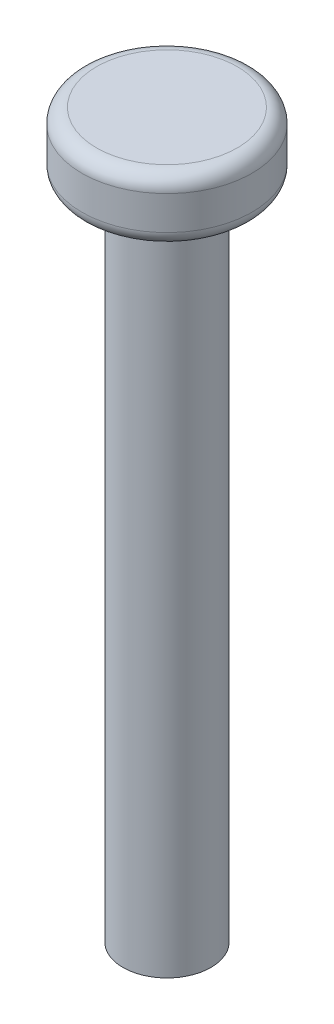
ISO-10303-21;
HEADER;
FILE_DESCRIPTION(('STEP AP214'),'2;1');
FILE_NAME('part.step','',(''),(''),'','','');
FILE_SCHEMA(('AUTOMOTIVE_DESIGN { 1 0 10303 214 1 1 1 1 }'));
ENDSEC;
DATA;
#1=APPLICATION_CONTEXT('core data for automotive mechanical design processes');
#2=APPLICATION_PROTOCOL_DEFINITION('international standard','automotive_design',2000,#1);
#3=PRODUCT_CONTEXT('',#1,'mechanical');
#4=PRODUCT('Part','Part','',(#3));
#5=PRODUCT_RELATED_PRODUCT_CATEGORY('part','',(#4));
#6=PRODUCT_DEFINITION_FORMATION('','',#4);
#7=PRODUCT_DEFINITION_CONTEXT('part definition',#1,'design');
#8=PRODUCT_DEFINITION('design','',#6,#7);
#9=PRODUCT_DEFINITION_SHAPE('','',#8);
#10=(LENGTH_UNIT() NAMED_UNIT(*) SI_UNIT(.MILLI.,.METRE.));
#11=(NAMED_UNIT(*) PLANE_ANGLE_UNIT() SI_UNIT($,.RADIAN.));
#12=(NAMED_UNIT(*) SI_UNIT($,.STERADIAN.) SOLID_ANGLE_UNIT());
#13=UNCERTAINTY_MEASURE_WITH_UNIT(LENGTH_MEASURE(1.E-05),#10,'distance_accuracy_value','');
#14=(GEOMETRIC_REPRESENTATION_CONTEXT(3) GLOBAL_UNCERTAINTY_ASSIGNED_CONTEXT((#13)) GLOBAL_UNIT_ASSIGNED_CONTEXT((#10,
#11,#12)) REPRESENTATION_CONTEXT('',''));
#15=CARTESIAN_POINT('',(0.,0.,0.));
#16=DIRECTION('',(0.,0.,1.));
#17=DIRECTION('',(1.,0.,0.));
#18=AXIS2_PLACEMENT_3D('',#15,#16,#17);
#19=CARTESIAN_POINT('',(0.,45.,0.));
#20=DIRECTION('',(0.,-1.,0.));
#21=DIRECTION('',(0.,0.,-1.));
#22=AXIS2_PLACEMENT_3D('',#19,#20,#21);
#23=CYLINDRICAL_SURFACE('',#22,3.);
#24=CARTESIAN_POINT('',(0.,45.,0.));
#25=DIRECTION('',(0.,1.,0.));
#26=DIRECTION('',(0.,0.,1.));
#27=AXIS2_PLACEMENT_3D('',#24,#25,#26);
#28=CIRCLE('',#27,3.);
#29=CARTESIAN_POINT('',(0.,45.,3.));
#30=VERTEX_POINT('',#29);
#31=EDGE_CURVE('E53',#30,#30,#28,.T.);
#32=ORIENTED_EDGE('',*,*,#31,.F.);
#33=EDGE_LOOP('',(#32));
#34=FACE_BOUND('',#33,.T.);
#35=CARTESIAN_POINT('',(0.,0.,0.));
#36=DIRECTION('',(0.,1.,0.));
#37=DIRECTION('',(0.,0.,1.));
#38=AXIS2_PLACEMENT_3D('',#35,#36,#37);
#39=CIRCLE('',#38,3.);
#40=CARTESIAN_POINT('',(0.,0.,3.));
#41=VERTEX_POINT('',#40);
#42=EDGE_CURVE('E54',#41,#41,#39,.T.);
#43=ORIENTED_EDGE('',*,*,#42,.T.);
#44=EDGE_LOOP('',(#43));
#45=FACE_BOUND('',#44,.T.);
#46=ADVANCED_FACE('F33',(#34,#45),#23,.T.);
#47=CARTESIAN_POINT('',(0.,0.,0.));
#48=DIRECTION('',(0.,1.,0.));
#49=DIRECTION('',(0.,0.,1.));
#50=AXIS2_PLACEMENT_3D('',#47,#48,#49);
#51=PLANE('',#50);
#52=ORIENTED_EDGE('',*,*,#42,.F.);
#53=EDGE_LOOP('',(#52));
#54=FACE_BOUND('',#53,.T.);
#55=ADVANCED_FACE('F64',(#54),#51,.F.);
#56=CARTESIAN_POINT('',(0.,49.3,0.));
#57=DIRECTION('',(0.,-1.,0.));
#58=DIRECTION('',(0.,0.,-1.));
#59=AXIS2_PLACEMENT_3D('',#56,#57,#58);
#60=CYLINDRICAL_SURFACE('',#59,5.8);
#61=CARTESIAN_POINT('',(0.,46.,0.));
#62=DIRECTION('',(0.,1.,0.));
#63=DIRECTION('',(0.,0.,1.));
#64=AXIS2_PLACEMENT_3D('',#61,#62,#63);
#65=CIRCLE('',#64,5.8);
#66=CARTESIAN_POINT('',(0.,46.,5.8));
#67=VERTEX_POINT('',#66);
#68=EDGE_CURVE('E44',#67,#67,#65,.T.);
#69=ORIENTED_EDGE('',*,*,#68,.T.);
#70=EDGE_LOOP('',(#69));
#71=FACE_BOUND('',#70,.T.);
#72=CARTESIAN_POINT('',(0.,48.3,0.));
#73=DIRECTION('',(0.,1.,0.));
#74=DIRECTION('',(0.,0.,1.));
#75=AXIS2_PLACEMENT_3D('',#72,#73,#74);
#76=CIRCLE('',#75,5.8);
#77=CARTESIAN_POINT('',(0.,48.3,5.8));
#78=VERTEX_POINT('',#77);
#79=EDGE_CURVE('E48',#78,#78,#76,.F.);
#80=ORIENTED_EDGE('',*,*,#79,.T.);
#81=EDGE_LOOP('',(#80));
#82=FACE_BOUND('',#81,.T.);
#83=ADVANCED_FACE('F69',(#71,#82),#60,.T.);
#84=CARTESIAN_POINT('',(0.,49.3,0.));
#85=DIRECTION('',(0.,1.,0.));
#86=DIRECTION('',(0.,0.,1.));
#87=AXIS2_PLACEMENT_3D('',#84,#85,#86);
#88=PLANE('',#87);
#89=CARTESIAN_POINT('',(0.,49.3,0.));
#90=DIRECTION('',(0.,1.,0.));
#91=DIRECTION('',(0.,0.,1.));
#92=AXIS2_PLACEMENT_3D('',#89,#90,#91);
#93=CIRCLE('',#92,4.8);
#94=CARTESIAN_POINT('',(0.,49.3,4.8));
#95=VERTEX_POINT('',#94);
#96=EDGE_CURVE('E10',#95,#95,#93,.T.);
#97=ORIENTED_EDGE('',*,*,#96,.T.);
#98=EDGE_LOOP('',(#97));
#99=FACE_BOUND('',#98,.T.);
#100=ADVANCED_FACE('F74',(#99),#88,.T.);
#101=CARTESIAN_POINT('',(0.,45.,0.));
#102=DIRECTION('',(0.,1.,0.));
#103=DIRECTION('',(0.,0.,1.));
#104=AXIS2_PLACEMENT_3D('',#101,#102,#103);
#105=PLANE('',#104);
#106=CARTESIAN_POINT('',(0.,45.,0.));
#107=DIRECTION('',(0.,1.,0.));
#108=DIRECTION('',(0.,0.,1.));
#109=AXIS2_PLACEMENT_3D('',#106,#107,#108);
#110=CIRCLE('',#109,4.8);
#111=CARTESIAN_POINT('',(0.,45.,4.8));
#112=VERTEX_POINT('',#111);
#113=EDGE_CURVE('E40',#112,#112,#110,.F.);
#114=ORIENTED_EDGE('',*,*,#113,.T.);
#115=EDGE_LOOP('',(#114));
#116=FACE_BOUND('',#115,.T.);
#117=ORIENTED_EDGE('',*,*,#31,.T.);
#118=EDGE_LOOP('',(#117));
#119=FACE_BOUND('',#118,.T.);
#120=ADVANCED_FACE('F60',(#116,#119),#105,.F.);
#121=CARTESIAN_POINT('',(0.,46.,0.));
#122=DIRECTION('',(0.,1.,0.));
#123=DIRECTION('',(0.,0.,1.));
#124=AXIS2_PLACEMENT_3D('',#121,#122,#123);
#125=TOROIDAL_SURFACE('',#124,4.8,1.);
#126=ORIENTED_EDGE('',*,*,#113,.F.);
#127=EDGE_LOOP('',(#126));
#128=FACE_BOUND('',#127,.T.);
#129=ORIENTED_EDGE('',*,*,#68,.F.);
#130=EDGE_LOOP('',(#129));
#131=FACE_BOUND('',#130,.T.);
#132=ADVANCED_FACE('F78',(#128,#131),#125,.T.);
#133=CARTESIAN_POINT('',(0.,48.3,0.));
#134=DIRECTION('',(0.,1.,0.));
#135=DIRECTION('',(0.,0.,1.));
#136=AXIS2_PLACEMENT_3D('',#133,#134,#135);
#137=TOROIDAL_SURFACE('',#136,4.8,1.);
#138=ORIENTED_EDGE('',*,*,#79,.F.);
#139=EDGE_LOOP('',(#138));
#140=FACE_BOUND('',#139,.T.);
#141=ORIENTED_EDGE('',*,*,#96,.F.);
#142=EDGE_LOOP('',(#141));
#143=FACE_BOUND('',#142,.T.);
#144=ADVANCED_FACE('F35',(#140,#143),#137,.T.);
#145=CLOSED_SHELL('',(#46,#55,#83,#100,#120,#132,#144));
#146=MANIFOLD_SOLID_BREP('B2',#145);
#147=ADVANCED_BREP_SHAPE_REPRESENTATION('',(#18,#146),#14);
#148=SHAPE_DEFINITION_REPRESENTATION(#9,#147);
ENDSEC;
END-ISO-10303-21;
